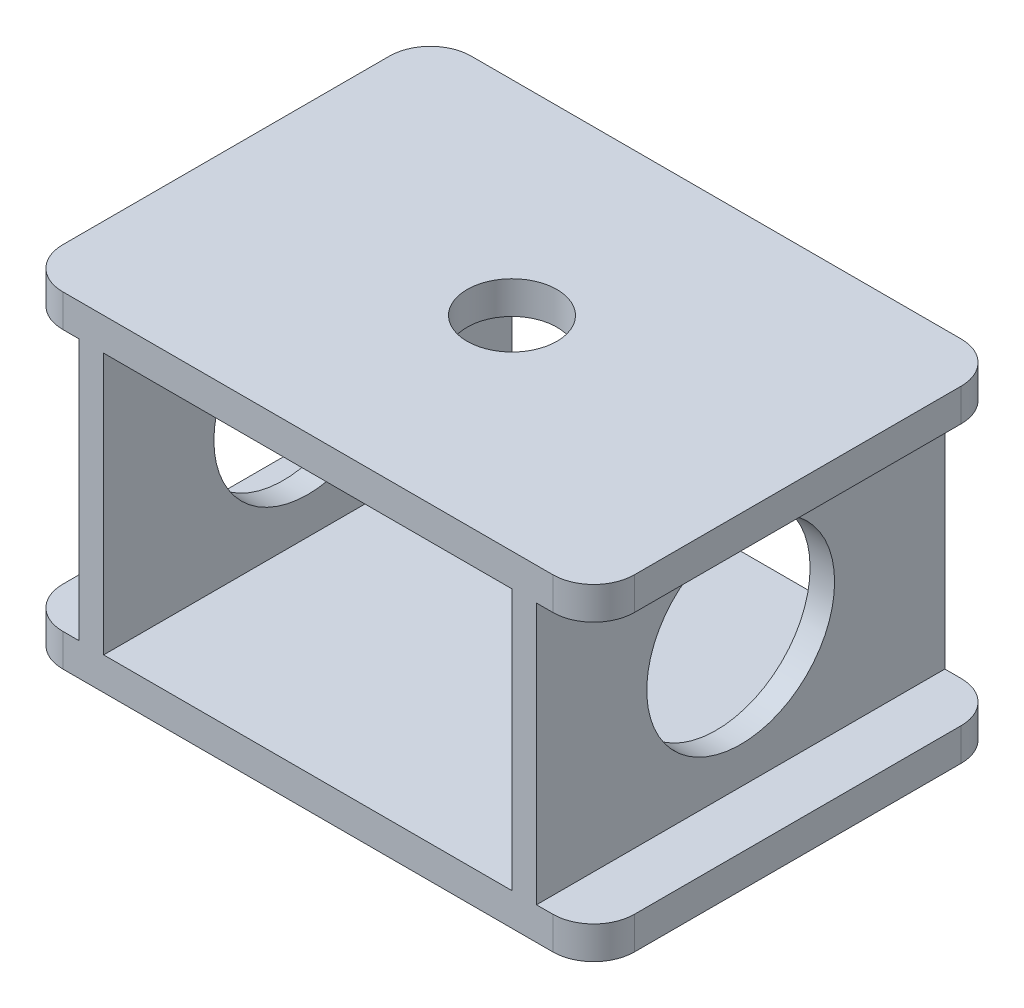
ISO-10303-21;
HEADER;
FILE_DESCRIPTION(('STEP AP214'),'2;1');
FILE_NAME('part.step','',(''),(''),'','','');
FILE_SCHEMA(('AUTOMOTIVE_DESIGN { 1 0 10303 214 1 1 1 1 }'));
ENDSEC;
DATA;
#1=APPLICATION_CONTEXT('core data for automotive mechanical design processes');
#2=APPLICATION_PROTOCOL_DEFINITION('international standard','automotive_design',2000,#1);
#3=PRODUCT_CONTEXT('',#1,'mechanical');
#4=PRODUCT('Part','Part','',(#3));
#5=PRODUCT_RELATED_PRODUCT_CATEGORY('part','',(#4));
#6=PRODUCT_DEFINITION_FORMATION('','',#4);
#7=PRODUCT_DEFINITION_CONTEXT('part definition',#1,'design');
#8=PRODUCT_DEFINITION('design','',#6,#7);
#9=PRODUCT_DEFINITION_SHAPE('','',#8);
#10=(LENGTH_UNIT() NAMED_UNIT(*) SI_UNIT(.MILLI.,.METRE.));
#11=(NAMED_UNIT(*) PLANE_ANGLE_UNIT() SI_UNIT($,.RADIAN.));
#12=(NAMED_UNIT(*) SI_UNIT($,.STERADIAN.) SOLID_ANGLE_UNIT());
#13=UNCERTAINTY_MEASURE_WITH_UNIT(LENGTH_MEASURE(1.E-05),#10,'distance_accuracy_value','');
#14=(GEOMETRIC_REPRESENTATION_CONTEXT(3) GLOBAL_UNCERTAINTY_ASSIGNED_CONTEXT((#13)) GLOBAL_UNIT_ASSIGNED_CONTEXT((#10,
#11,#12)) REPRESENTATION_CONTEXT('',''));
#15=CARTESIAN_POINT('',(0.,0.,0.));
#16=DIRECTION('',(0.,0.,1.));
#17=DIRECTION('',(1.,0.,0.));
#18=AXIS2_PLACEMENT_3D('',#15,#16,#17);
#19=CARTESIAN_POINT('',(30.,4.,20.));
#20=DIRECTION('',(0.,1.,0.));
#21=DIRECTION('',(0.,0.,1.));
#22=AXIS2_PLACEMENT_3D('',#19,#20,#21);
#23=PLANE('',#22);
#24=DIRECTION('',(1.,0.,0.));
#25=VECTOR('',#24,1.);
#26=CARTESIAN_POINT('',(-30.,4.,25.));
#27=LINE('',#26,#25);
#28=CARTESIAN_POINT('',(-25.,4.,25.));
#29=VERTEX_POINT('',#28);
#30=CARTESIAN_POINT('',(25.,4.,25.));
#31=VERTEX_POINT('',#30);
#32=EDGE_CURVE('E293',#29,#31,#27,.T.);
#33=ORIENTED_EDGE('',*,*,#32,.T.);
#34=DIRECTION('',(0.,0.,1.));
#35=VECTOR('',#34,1.);
#36=CARTESIAN_POINT('',(25.,4.,-25.));
#37=LINE('',#36,#35);
#38=CARTESIAN_POINT('',(25.,4.,-25.));
#39=VERTEX_POINT('',#38);
#40=EDGE_CURVE('E220',#39,#31,#37,.T.);
#41=ORIENTED_EDGE('',*,*,#40,.F.);
#42=DIRECTION('',(-1.,0.,0.));
#43=VECTOR('',#42,1.);
#44=CARTESIAN_POINT('',(-30.,4.,-25.));
#45=LINE('',#44,#43);
#46=CARTESIAN_POINT('',(-25.,4.,-25.));
#47=VERTEX_POINT('',#46);
#48=EDGE_CURVE('E283',#39,#47,#45,.T.);
#49=ORIENTED_EDGE('',*,*,#48,.T.);
#50=DIRECTION('',(0.,0.,-1.));
#51=VECTOR('',#50,1.);
#52=CARTESIAN_POINT('',(-25.,4.,-25.));
#53=LINE('',#52,#51);
#54=EDGE_CURVE('E252',#29,#47,#53,.T.);
#55=ORIENTED_EDGE('',*,*,#54,.F.);
#56=EDGE_LOOP('',(#33,#41,#49,#55));
#57=FACE_BOUND('',#56,.T.);
#58=ADVANCED_FACE('F36',(#57),#23,.T.);
#59=CARTESIAN_POINT('',(30.,4.,-25.));
#60=VERTEX_POINT('',#59);
#61=CARTESIAN_POINT('',(28.,4.,-25.));
#62=VERTEX_POINT('',#61);
#63=EDGE_CURVE('E51',#60,#62,#45,.T.);
#64=ORIENTED_EDGE('',*,*,#63,.T.);
#65=DIRECTION('',(0.,0.,-1.));
#66=VECTOR('',#65,1.);
#67=CARTESIAN_POINT('',(28.,4.,-25.));
#68=LINE('',#67,#66);
#69=CARTESIAN_POINT('',(28.,4.,25.));
#70=VERTEX_POINT('',#69);
#71=EDGE_CURVE('E55',#70,#62,#68,.T.);
#72=ORIENTED_EDGE('',*,*,#71,.F.);
#73=CARTESIAN_POINT('',(30.,4.,25.));
#74=VERTEX_POINT('',#73);
#75=EDGE_CURVE('E289',#70,#74,#27,.T.);
#76=ORIENTED_EDGE('',*,*,#75,.T.);
#77=CARTESIAN_POINT('',(30.,4.,20.));
#78=DIRECTION('',(0.,1.,0.));
#79=DIRECTION('',(0.,0.,1.));
#80=AXIS2_PLACEMENT_3D('',#77,#78,#79);
#81=CIRCLE('',#80,5.);
#82=CARTESIAN_POINT('',(35.,4.,20.));
#83=VERTEX_POINT('',#82);
#84=EDGE_CURVE('E272',#74,#83,#81,.T.);
#85=ORIENTED_EDGE('',*,*,#84,.T.);
#86=DIRECTION('',(0.,0.,-1.));
#87=VECTOR('',#86,1.);
#88=CARTESIAN_POINT('',(35.,4.,-20.));
#89=LINE('',#88,#87);
#90=CARTESIAN_POINT('',(35.,4.,-20.));
#91=VERTEX_POINT('',#90);
#92=EDGE_CURVE('E275',#83,#91,#89,.T.);
#93=ORIENTED_EDGE('',*,*,#92,.T.);
#94=CARTESIAN_POINT('',(30.,4.,-20.));
#95=DIRECTION('',(0.,1.,0.));
#96=DIRECTION('',(0.,0.,-1.));
#97=AXIS2_PLACEMENT_3D('',#94,#95,#96);
#98=CIRCLE('',#97,5.);
#99=EDGE_CURVE('E278',#91,#60,#98,.T.);
#100=ORIENTED_EDGE('',*,*,#99,.T.);
#101=EDGE_LOOP('',(#64,#72,#76,#85,#93,#100));
#102=FACE_BOUND('',#101,.T.);
#103=ADVANCED_FACE('F459',(#102),#23,.T.);
#104=DIRECTION('',(0.,0.,1.));
#105=VECTOR('',#104,1.);
#106=CARTESIAN_POINT('',(-28.,4.,-25.));
#107=LINE('',#106,#105);
#108=CARTESIAN_POINT('',(-28.,4.,-25.));
#109=VERTEX_POINT('',#108);
#110=CARTESIAN_POINT('',(-28.,4.,25.));
#111=VERTEX_POINT('',#110);
#112=EDGE_CURVE('E247',#109,#111,#107,.T.);
#113=ORIENTED_EDGE('',*,*,#112,.F.);
#114=CARTESIAN_POINT('',(-30.,4.,-25.));
#115=VERTEX_POINT('',#114);
#116=EDGE_CURVE('E280',#109,#115,#45,.T.);
#117=ORIENTED_EDGE('',*,*,#116,.T.);
#118=CARTESIAN_POINT('',(-30.,4.,-20.));
#119=DIRECTION('',(0.,1.,0.));
#120=DIRECTION('',(0.,0.,1.));
#121=AXIS2_PLACEMENT_3D('',#118,#119,#120);
#122=CIRCLE('',#121,5.);
#123=CARTESIAN_POINT('',(-35.,4.,-20.));
#124=VERTEX_POINT('',#123);
#125=EDGE_CURVE('E282',#115,#124,#122,.T.);
#126=ORIENTED_EDGE('',*,*,#125,.T.);
#127=DIRECTION('',(0.,0.,1.));
#128=VECTOR('',#127,1.);
#129=CARTESIAN_POINT('',(-35.,4.,-20.));
#130=LINE('',#129,#128);
#131=CARTESIAN_POINT('',(-35.,4.,20.));
#132=VERTEX_POINT('',#131);
#133=EDGE_CURVE('E285',#124,#132,#130,.T.);
#134=ORIENTED_EDGE('',*,*,#133,.T.);
#135=CARTESIAN_POINT('',(-30.,4.,20.));
#136=DIRECTION('',(0.,1.,0.));
#137=DIRECTION('',(0.,0.,1.));
#138=AXIS2_PLACEMENT_3D('',#135,#136,#137);
#139=CIRCLE('',#138,5.);
#140=CARTESIAN_POINT('',(-30.,4.,25.));
#141=VERTEX_POINT('',#140);
#142=EDGE_CURVE('E287',#132,#141,#139,.T.);
#143=ORIENTED_EDGE('',*,*,#142,.T.);
#144=EDGE_CURVE('E290',#141,#111,#27,.T.);
#145=ORIENTED_EDGE('',*,*,#144,.T.);
#146=EDGE_LOOP('',(#113,#117,#126,#134,#143,#145));
#147=FACE_BOUND('',#146,.T.);
#148=ADVANCED_FACE('F351',(#147),#23,.T.);
#149=CARTESIAN_POINT('',(30.,4.,20.));
#150=DIRECTION('',(0.,-1.,0.));
#151=DIRECTION('',(0.,0.,-1.));
#152=AXIS2_PLACEMENT_3D('',#149,#150,#151);
#153=CYLINDRICAL_SURFACE('',#152,5.);
#154=CARTESIAN_POINT('',(30.,0.,20.));
#155=DIRECTION('',(0.,1.,0.));
#156=DIRECTION('',(0.,0.,1.));
#157=AXIS2_PLACEMENT_3D('',#154,#155,#156);
#158=CIRCLE('',#157,5.);
#159=CARTESIAN_POINT('',(30.,0.,25.));
#160=VERTEX_POINT('',#159);
#161=CARTESIAN_POINT('',(35.,0.,20.));
#162=VERTEX_POINT('',#161);
#163=EDGE_CURVE('E271',#160,#162,#158,.T.);
#164=ORIENTED_EDGE('',*,*,#163,.T.);
#165=DIRECTION('',(0.,-1.,0.));
#166=VECTOR('',#165,1.);
#167=CARTESIAN_POINT('',(35.,4.,20.));
#168=LINE('',#167,#166);
#169=EDGE_CURVE('E11',#83,#162,#168,.T.);
#170=ORIENTED_EDGE('',*,*,#169,.F.);
#171=ORIENTED_EDGE('',*,*,#84,.F.);
#172=DIRECTION('',(0.,-1.,0.));
#173=VECTOR('',#172,1.);
#174=CARTESIAN_POINT('',(30.,4.,25.));
#175=LINE('',#174,#173);
#176=EDGE_CURVE('E292',#74,#160,#175,.T.);
#177=ORIENTED_EDGE('',*,*,#176,.T.);
#178=EDGE_LOOP('',(#164,#170,#171,#177));
#179=FACE_BOUND('',#178,.T.);
#180=ADVANCED_FACE('F38',(#179),#153,.T.);
#181=CARTESIAN_POINT('',(35.,4.,-20.));
#182=DIRECTION('',(-1.,0.,0.));
#183=DIRECTION('',(0.,0.,1.));
#184=AXIS2_PLACEMENT_3D('',#181,#182,#183);
#185=PLANE('',#184);
#186=DIRECTION('',(0.,0.,-1.));
#187=VECTOR('',#186,1.);
#188=CARTESIAN_POINT('',(35.,0.,-20.));
#189=LINE('',#188,#187);
#190=CARTESIAN_POINT('',(35.,0.,-20.));
#191=VERTEX_POINT('',#190);
#192=EDGE_CURVE('E296',#162,#191,#189,.T.);
#193=ORIENTED_EDGE('',*,*,#192,.T.);
#194=DIRECTION('',(0.,-1.,0.));
#195=VECTOR('',#194,1.);
#196=CARTESIAN_POINT('',(35.,4.,-20.));
#197=LINE('',#196,#195);
#198=EDGE_CURVE('E44',#91,#191,#197,.T.);
#199=ORIENTED_EDGE('',*,*,#198,.F.);
#200=ORIENTED_EDGE('',*,*,#92,.F.);
#201=ORIENTED_EDGE('',*,*,#169,.T.);
#202=EDGE_LOOP('',(#193,#199,#200,#201));
#203=FACE_BOUND('',#202,.T.);
#204=ADVANCED_FACE('F470',(#203),#185,.F.);
#205=CARTESIAN_POINT('',(30.,4.,-20.));
#206=DIRECTION('',(0.,-1.,0.));
#207=DIRECTION('',(0.,0.,-1.));
#208=AXIS2_PLACEMENT_3D('',#205,#206,#207);
#209=CYLINDRICAL_SURFACE('',#208,5.);
#210=CARTESIAN_POINT('',(30.,0.,-20.));
#211=DIRECTION('',(0.,1.,0.));
#212=DIRECTION('',(0.,0.,-1.));
#213=AXIS2_PLACEMENT_3D('',#210,#211,#212);
#214=CIRCLE('',#213,5.);
#215=CARTESIAN_POINT('',(30.,0.,-25.));
#216=VERTEX_POINT('',#215);
#217=EDGE_CURVE('E298',#191,#216,#214,.T.);
#218=ORIENTED_EDGE('',*,*,#217,.T.);
#219=DIRECTION('',(0.,-1.,0.));
#220=VECTOR('',#219,1.);
#221=CARTESIAN_POINT('',(30.,4.,-25.));
#222=LINE('',#221,#220);
#223=EDGE_CURVE('E323',#60,#216,#222,.T.);
#224=ORIENTED_EDGE('',*,*,#223,.F.);
#225=ORIENTED_EDGE('',*,*,#99,.F.);
#226=ORIENTED_EDGE('',*,*,#198,.T.);
#227=EDGE_LOOP('',(#218,#224,#225,#226));
#228=FACE_BOUND('',#227,.T.);
#229=ADVANCED_FACE('F330',(#228),#209,.T.);
#230=CARTESIAN_POINT('',(-30.,4.,-25.));
#231=DIRECTION('',(0.,0.,1.));
#232=DIRECTION('',(1.,0.,0.));
#233=AXIS2_PLACEMENT_3D('',#230,#231,#232);
#234=PLANE('',#233);
#235=DIRECTION('',(0.,-1.,0.));
#236=VECTOR('',#235,1.);
#237=CARTESIAN_POINT('',(-28.,36.,-25.));
#238=LINE('',#237,#236);
#239=CARTESIAN_POINT('',(-28.,36.,-25.));
#240=VERTEX_POINT('',#239);
#241=EDGE_CURVE('E255',#240,#109,#238,.T.);
#242=ORIENTED_EDGE('',*,*,#241,.F.);
#243=DIRECTION('',(-1.,0.,0.));
#244=VECTOR('',#243,1.);
#245=CARTESIAN_POINT('',(0.,36.,-25.));
#246=LINE('',#245,#244);
#247=CARTESIAN_POINT('',(-30.,36.,-25.));
#248=VERTEX_POINT('',#247);
#249=EDGE_CURVE('E365',#240,#248,#246,.T.);
#250=ORIENTED_EDGE('',*,*,#249,.T.);
#251=DIRECTION('',(0.,-1.,0.));
#252=VECTOR('',#251,1.);
#253=CARTESIAN_POINT('',(-30.,40.,-25.));
#254=LINE('',#253,#252);
#255=CARTESIAN_POINT('',(-30.,40.,-25.));
#256=VERTEX_POINT('',#255);
#257=EDGE_CURVE('E375',#256,#248,#254,.T.);
#258=ORIENTED_EDGE('',*,*,#257,.F.);
#259=DIRECTION('',(-1.,0.,0.));
#260=VECTOR('',#259,1.);
#261=CARTESIAN_POINT('',(0.,40.,-25.));
#262=LINE('',#261,#260);
#263=CARTESIAN_POINT('',(30.,40.,-25.));
#264=VERTEX_POINT('',#263);
#265=EDGE_CURVE('E414',#264,#256,#262,.T.);
#266=ORIENTED_EDGE('',*,*,#265,.F.);
#267=DIRECTION('',(0.,-1.,0.));
#268=VECTOR('',#267,1.);
#269=CARTESIAN_POINT('',(30.,40.,-25.));
#270=LINE('',#269,#268);
#271=CARTESIAN_POINT('',(30.,36.,-25.));
#272=VERTEX_POINT('',#271);
#273=EDGE_CURVE('E378',#264,#272,#270,.T.);
#274=ORIENTED_EDGE('',*,*,#273,.T.);
#275=CARTESIAN_POINT('',(28.,36.,-25.));
#276=VERTEX_POINT('',#275);
#277=EDGE_CURVE('E364',#272,#276,#246,.T.);
#278=ORIENTED_EDGE('',*,*,#277,.T.);
#279=DIRECTION('',(0.,-1.,0.));
#280=VECTOR('',#279,1.);
#281=CARTESIAN_POINT('',(28.,36.,-25.));
#282=LINE('',#281,#280);
#283=EDGE_CURVE('E238',#276,#62,#282,.T.);
#284=ORIENTED_EDGE('',*,*,#283,.T.);
#285=ORIENTED_EDGE('',*,*,#63,.F.);
#286=ORIENTED_EDGE('',*,*,#223,.T.);
#287=DIRECTION('',(-1.,0.,0.));
#288=VECTOR('',#287,1.);
#289=CARTESIAN_POINT('',(-30.,0.,-25.));
#290=LINE('',#289,#288);
#291=CARTESIAN_POINT('',(-30.,0.,-25.));
#292=VERTEX_POINT('',#291);
#293=EDGE_CURVE('E300',#216,#292,#290,.T.);
#294=ORIENTED_EDGE('',*,*,#293,.T.);
#295=DIRECTION('',(0.,-1.,0.));
#296=VECTOR('',#295,1.);
#297=CARTESIAN_POINT('',(-30.,4.,-25.));
#298=LINE('',#297,#296);
#299=EDGE_CURVE('E320',#115,#292,#298,.T.);
#300=ORIENTED_EDGE('',*,*,#299,.F.);
#301=ORIENTED_EDGE('',*,*,#116,.F.);
#302=EDGE_LOOP('',(#242,#250,#258,#266,#274,#278,#284,#285,#286,#294,#300,#301));
#303=FACE_BOUND('',#302,.T.);
#304=CARTESIAN_POINT('',(25.,36.,-25.));
#305=VERTEX_POINT('',#304);
#306=CARTESIAN_POINT('',(-25.,36.,-25.));
#307=VERTEX_POINT('',#306);
#308=EDGE_CURVE('E362',#305,#307,#246,.T.);
#309=ORIENTED_EDGE('',*,*,#308,.T.);
#310=DIRECTION('',(0.,-1.,0.));
#311=VECTOR('',#310,1.);
#312=CARTESIAN_POINT('',(-25.,36.,-25.));
#313=LINE('',#312,#311);
#314=EDGE_CURVE('E262',#307,#47,#313,.T.);
#315=ORIENTED_EDGE('',*,*,#314,.T.);
#316=ORIENTED_EDGE('',*,*,#48,.F.);
#317=DIRECTION('',(0.,-1.,0.));
#318=VECTOR('',#317,1.);
#319=CARTESIAN_POINT('',(25.,36.,-25.));
#320=LINE('',#319,#318);
#321=EDGE_CURVE('E233',#305,#39,#320,.T.);
#322=ORIENTED_EDGE('',*,*,#321,.F.);
#323=EDGE_LOOP('',(#309,#315,#316,#322));
#324=FACE_BOUND('',#323,.T.);
#325=ADVANCED_FACE('F342',(#303,#324),#234,.F.);
#326=CARTESIAN_POINT('',(-30.,4.,-20.));
#327=DIRECTION('',(0.,-1.,0.));
#328=DIRECTION('',(0.,0.,-1.));
#329=AXIS2_PLACEMENT_3D('',#326,#327,#328);
#330=CYLINDRICAL_SURFACE('',#329,5.);
#331=CARTESIAN_POINT('',(-30.,0.,-20.));
#332=DIRECTION('',(0.,1.,0.));
#333=DIRECTION('',(0.,0.,1.));
#334=AXIS2_PLACEMENT_3D('',#331,#332,#333);
#335=CIRCLE('',#334,5.);
#336=CARTESIAN_POINT('',(-35.,0.,-20.));
#337=VERTEX_POINT('',#336);
#338=EDGE_CURVE('E302',#292,#337,#335,.T.);
#339=ORIENTED_EDGE('',*,*,#338,.T.);
#340=DIRECTION('',(0.,-1.,0.));
#341=VECTOR('',#340,1.);
#342=CARTESIAN_POINT('',(-35.,4.,-20.));
#343=LINE('',#342,#341);
#344=EDGE_CURVE('E317',#124,#337,#343,.T.);
#345=ORIENTED_EDGE('',*,*,#344,.F.);
#346=ORIENTED_EDGE('',*,*,#125,.F.);
#347=ORIENTED_EDGE('',*,*,#299,.T.);
#348=EDGE_LOOP('',(#339,#345,#346,#347));
#349=FACE_BOUND('',#348,.T.);
#350=ADVANCED_FACE('F347',(#349),#330,.T.);
#351=CARTESIAN_POINT('',(-35.,4.,-20.));
#352=DIRECTION('',(1.,0.,0.));
#353=DIRECTION('',(0.,0.,-1.));
#354=AXIS2_PLACEMENT_3D('',#351,#352,#353);
#355=PLANE('',#354);
#356=DIRECTION('',(0.,0.,1.));
#357=VECTOR('',#356,1.);
#358=CARTESIAN_POINT('',(-35.,0.,-20.));
#359=LINE('',#358,#357);
#360=CARTESIAN_POINT('',(-35.,0.,20.));
#361=VERTEX_POINT('',#360);
#362=EDGE_CURVE('E304',#337,#361,#359,.T.);
#363=ORIENTED_EDGE('',*,*,#362,.T.);
#364=DIRECTION('',(0.,-1.,0.));
#365=VECTOR('',#364,1.);
#366=CARTESIAN_POINT('',(-35.,4.,20.));
#367=LINE('',#366,#365);
#368=EDGE_CURVE('E314',#132,#361,#367,.T.);
#369=ORIENTED_EDGE('',*,*,#368,.F.);
#370=ORIENTED_EDGE('',*,*,#133,.F.);
#371=ORIENTED_EDGE('',*,*,#344,.T.);
#372=EDGE_LOOP('',(#363,#369,#370,#371));
#373=FACE_BOUND('',#372,.T.);
#374=ADVANCED_FACE('F487',(#373),#355,.F.);
#375=CARTESIAN_POINT('',(-30.,4.,20.));
#376=DIRECTION('',(0.,-1.,0.));
#377=DIRECTION('',(0.,0.,-1.));
#378=AXIS2_PLACEMENT_3D('',#375,#376,#377);
#379=CYLINDRICAL_SURFACE('',#378,5.);
#380=CARTESIAN_POINT('',(-30.,0.,20.));
#381=DIRECTION('',(0.,1.,0.));
#382=DIRECTION('',(0.,0.,1.));
#383=AXIS2_PLACEMENT_3D('',#380,#381,#382);
#384=CIRCLE('',#383,5.);
#385=CARTESIAN_POINT('',(-30.,0.,25.));
#386=VERTEX_POINT('',#385);
#387=EDGE_CURVE('E306',#361,#386,#384,.T.);
#388=ORIENTED_EDGE('',*,*,#387,.T.);
#389=DIRECTION('',(0.,-1.,0.));
#390=VECTOR('',#389,1.);
#391=CARTESIAN_POINT('',(-30.,4.,25.));
#392=LINE('',#391,#390);
#393=EDGE_CURVE('E311',#141,#386,#392,.T.);
#394=ORIENTED_EDGE('',*,*,#393,.F.);
#395=ORIENTED_EDGE('',*,*,#142,.F.);
#396=ORIENTED_EDGE('',*,*,#368,.T.);
#397=EDGE_LOOP('',(#388,#394,#395,#396));
#398=FACE_BOUND('',#397,.T.);
#399=ADVANCED_FACE('F485',(#398),#379,.T.);
#400=CARTESIAN_POINT('',(-30.,4.,25.));
#401=DIRECTION('',(0.,0.,-1.));
#402=DIRECTION('',(-1.,0.,0.));
#403=AXIS2_PLACEMENT_3D('',#400,#401,#402);
#404=PLANE('',#403);
#405=DIRECTION('',(0.,-1.,0.));
#406=VECTOR('',#405,1.);
#407=CARTESIAN_POINT('',(-25.,36.,25.));
#408=LINE('',#407,#406);
#409=CARTESIAN_POINT('',(-25.,36.,25.));
#410=VERTEX_POINT('',#409);
#411=EDGE_CURVE('E265',#410,#29,#408,.T.);
#412=ORIENTED_EDGE('',*,*,#411,.F.);
#413=DIRECTION('',(1.,0.,0.));
#414=VECTOR('',#413,1.);
#415=CARTESIAN_POINT('',(0.,36.,25.));
#416=LINE('',#415,#414);
#417=CARTESIAN_POINT('',(25.,36.,25.));
#418=VERTEX_POINT('',#417);
#419=EDGE_CURVE('E406',#410,#418,#416,.T.);
#420=ORIENTED_EDGE('',*,*,#419,.T.);
#421=DIRECTION('',(0.,-1.,0.));
#422=VECTOR('',#421,1.);
#423=CARTESIAN_POINT('',(25.,36.,25.));
#424=LINE('',#423,#422);
#425=EDGE_CURVE('E244',#418,#31,#424,.T.);
#426=ORIENTED_EDGE('',*,*,#425,.T.);
#427=ORIENTED_EDGE('',*,*,#32,.F.);
#428=EDGE_LOOP('',(#412,#420,#426,#427));
#429=FACE_BOUND('',#428,.T.);
#430=DIRECTION('',(1.,0.,0.));
#431=VECTOR('',#430,1.);
#432=CARTESIAN_POINT('',(-30.,0.,25.));
#433=LINE('',#432,#431);
#434=EDGE_CURVE('E276',#386,#160,#433,.T.);
#435=ORIENTED_EDGE('',*,*,#434,.T.);
#436=ORIENTED_EDGE('',*,*,#176,.F.);
#437=ORIENTED_EDGE('',*,*,#75,.F.);
#438=DIRECTION('',(0.,-1.,0.));
#439=VECTOR('',#438,1.);
#440=CARTESIAN_POINT('',(28.,36.,25.));
#441=LINE('',#440,#439);
#442=CARTESIAN_POINT('',(28.,36.,25.));
#443=VERTEX_POINT('',#442);
#444=EDGE_CURVE('E241',#443,#70,#441,.T.);
#445=ORIENTED_EDGE('',*,*,#444,.F.);
#446=CARTESIAN_POINT('',(30.,36.,25.));
#447=VERTEX_POINT('',#446);
#448=EDGE_CURVE('E400',#443,#447,#416,.T.);
#449=ORIENTED_EDGE('',*,*,#448,.T.);
#450=DIRECTION('',(0.,-1.,0.));
#451=VECTOR('',#450,1.);
#452=CARTESIAN_POINT('',(30.,40.,25.));
#453=LINE('',#452,#451);
#454=CARTESIAN_POINT('',(30.,40.,25.));
#455=VERTEX_POINT('',#454);
#456=EDGE_CURVE('E224',#455,#447,#453,.T.);
#457=ORIENTED_EDGE('',*,*,#456,.F.);
#458=DIRECTION('',(1.,0.,0.));
#459=VECTOR('',#458,1.);
#460=CARTESIAN_POINT('',(0.,40.,25.));
#461=LINE('',#460,#459);
#462=CARTESIAN_POINT('',(-30.,40.,25.));
#463=VERTEX_POINT('',#462);
#464=EDGE_CURVE('E205',#463,#455,#461,.T.);
#465=ORIENTED_EDGE('',*,*,#464,.F.);
#466=DIRECTION('',(0.,-1.,0.));
#467=VECTOR('',#466,1.);
#468=CARTESIAN_POINT('',(-30.,40.,25.));
#469=LINE('',#468,#467);
#470=CARTESIAN_POINT('',(-30.,36.,25.));
#471=VERTEX_POINT('',#470);
#472=EDGE_CURVE('E202',#463,#471,#469,.T.);
#473=ORIENTED_EDGE('',*,*,#472,.T.);
#474=CARTESIAN_POINT('',(-28.,36.,25.));
#475=VERTEX_POINT('',#474);
#476=EDGE_CURVE('E403',#471,#475,#416,.T.);
#477=ORIENTED_EDGE('',*,*,#476,.T.);
#478=DIRECTION('',(0.,-1.,0.));
#479=VECTOR('',#478,1.);
#480=CARTESIAN_POINT('',(-28.,36.,25.));
#481=LINE('',#480,#479);
#482=EDGE_CURVE('E268',#475,#111,#481,.T.);
#483=ORIENTED_EDGE('',*,*,#482,.T.);
#484=ORIENTED_EDGE('',*,*,#144,.F.);
#485=ORIENTED_EDGE('',*,*,#393,.T.);
#486=EDGE_LOOP('',(#435,#436,#437,#445,#449,#457,#465,#473,#477,#483,#484,#485));
#487=FACE_BOUND('',#486,.T.);
#488=ADVANCED_FACE('F480',(#429,#487),#404,.F.);
#489=CARTESIAN_POINT('',(30.,0.,20.));
#490=DIRECTION('',(0.,1.,0.));
#491=DIRECTION('',(0.,0.,1.));
#492=AXIS2_PLACEMENT_3D('',#489,#490,#491);
#493=PLANE('',#492);
#494=ORIENTED_EDGE('',*,*,#163,.F.);
#495=ORIENTED_EDGE('',*,*,#434,.F.);
#496=ORIENTED_EDGE('',*,*,#387,.F.);
#497=ORIENTED_EDGE('',*,*,#362,.F.);
#498=ORIENTED_EDGE('',*,*,#338,.F.);
#499=ORIENTED_EDGE('',*,*,#293,.F.);
#500=ORIENTED_EDGE('',*,*,#217,.F.);
#501=ORIENTED_EDGE('',*,*,#192,.F.);
#502=EDGE_LOOP('',(#494,#495,#496,#497,#498,#499,#500,#501));
#503=FACE_BOUND('',#502,.T.);
#504=ADVANCED_FACE('F336',(#503),#493,.F.);
#505=CARTESIAN_POINT('',(-28.,36.,-25.));
#506=DIRECTION('',(1.,0.,0.));
#507=DIRECTION('',(0.,0.,-1.));
#508=AXIS2_PLACEMENT_3D('',#505,#506,#507);
#509=PLANE('',#508);
#510=CARTESIAN_POINT('',(-28.,20.,0.));
#511=DIRECTION('',(1.,0.,0.));
#512=DIRECTION('',(0.,0.,-1.));
#513=AXIS2_PLACEMENT_3D('',#510,#511,#512);
#514=CIRCLE('',#513,11.5);
#515=CARTESIAN_POINT('',(-28.,20.,-11.5));
#516=VERTEX_POINT('',#515);
#517=EDGE_CURVE('E412',#516,#516,#514,.T.);
#518=ORIENTED_EDGE('',*,*,#517,.T.);
#519=EDGE_LOOP('',(#518));
#520=FACE_BOUND('',#519,.T.);
#521=ORIENTED_EDGE('',*,*,#112,.T.);
#522=ORIENTED_EDGE('',*,*,#482,.F.);
#523=DIRECTION('',(0.,0.,1.));
#524=VECTOR('',#523,1.);
#525=CARTESIAN_POINT('',(-28.,36.,-25.));
#526=LINE('',#525,#524);
#527=EDGE_CURVE('E248',#240,#475,#526,.T.);
#528=ORIENTED_EDGE('',*,*,#527,.F.);
#529=ORIENTED_EDGE('',*,*,#241,.T.);
#530=EDGE_LOOP('',(#521,#522,#528,#529));
#531=FACE_BOUND('',#530,.T.);
#532=ADVANCED_FACE('F535',(#520,#531),#509,.F.);
#533=CARTESIAN_POINT('',(-25.,36.,-25.));
#534=DIRECTION('',(-1.,0.,0.));
#535=DIRECTION('',(0.,0.,1.));
#536=AXIS2_PLACEMENT_3D('',#533,#534,#535);
#537=PLANE('',#536);
#538=CARTESIAN_POINT('',(-25.,20.,0.));
#539=DIRECTION('',(-1.,0.,0.));
#540=DIRECTION('',(0.,0.,1.));
#541=AXIS2_PLACEMENT_3D('',#538,#539,#540);
#542=CIRCLE('',#541,11.5);
#543=CARTESIAN_POINT('',(-25.,20.,11.5));
#544=VERTEX_POINT('',#543);
#545=EDGE_CURVE('E424',#544,#544,#542,.T.);
#546=ORIENTED_EDGE('',*,*,#545,.T.);
#547=EDGE_LOOP('',(#546));
#548=FACE_BOUND('',#547,.T.);
#549=ORIENTED_EDGE('',*,*,#54,.T.);
#550=ORIENTED_EDGE('',*,*,#314,.F.);
#551=DIRECTION('',(0.,0.,-1.));
#552=VECTOR('',#551,1.);
#553=CARTESIAN_POINT('',(-25.,36.,-25.));
#554=LINE('',#553,#552);
#555=EDGE_CURVE('E251',#410,#307,#554,.T.);
#556=ORIENTED_EDGE('',*,*,#555,.F.);
#557=ORIENTED_EDGE('',*,*,#411,.T.);
#558=EDGE_LOOP('',(#549,#550,#556,#557));
#559=FACE_BOUND('',#558,.T.);
#560=ADVANCED_FACE('F358',(#548,#559),#537,.F.);
#561=CARTESIAN_POINT('',(25.,36.,-25.));
#562=DIRECTION('',(1.,0.,0.));
#563=DIRECTION('',(0.,0.,-1.));
#564=AXIS2_PLACEMENT_3D('',#561,#562,#563);
#565=PLANE('',#564);
#566=CARTESIAN_POINT('',(25.,20.,0.));
#567=DIRECTION('',(1.,0.,0.));
#568=DIRECTION('',(0.,0.,-1.));
#569=AXIS2_PLACEMENT_3D('',#566,#567,#568);
#570=CIRCLE('',#569,11.5);
#571=CARTESIAN_POINT('',(25.,20.,-11.5));
#572=VERTEX_POINT('',#571);
#573=EDGE_CURVE('E427',#572,#572,#570,.T.);
#574=ORIENTED_EDGE('',*,*,#573,.T.);
#575=EDGE_LOOP('',(#574));
#576=FACE_BOUND('',#575,.T.);
#577=ORIENTED_EDGE('',*,*,#40,.T.);
#578=ORIENTED_EDGE('',*,*,#425,.F.);
#579=DIRECTION('',(0.,0.,1.));
#580=VECTOR('',#579,1.);
#581=CARTESIAN_POINT('',(25.,36.,-25.));
#582=LINE('',#581,#580);
#583=EDGE_CURVE('E228',#305,#418,#582,.T.);
#584=ORIENTED_EDGE('',*,*,#583,.F.);
#585=ORIENTED_EDGE('',*,*,#321,.T.);
#586=EDGE_LOOP('',(#577,#578,#584,#585));
#587=FACE_BOUND('',#586,.T.);
#588=ADVANCED_FACE('F593',(#576,#587),#565,.F.);
#589=CARTESIAN_POINT('',(28.,36.,-25.));
#590=DIRECTION('',(-1.,0.,0.));
#591=DIRECTION('',(0.,0.,1.));
#592=AXIS2_PLACEMENT_3D('',#589,#590,#591);
#593=PLANE('',#592);
#594=CARTESIAN_POINT('',(28.,20.,0.));
#595=DIRECTION('',(1.,0.,0.));
#596=DIRECTION('',(0.,0.,-1.));
#597=AXIS2_PLACEMENT_3D('',#594,#595,#596);
#598=CIRCLE('',#597,11.5);
#599=CARTESIAN_POINT('',(28.,20.,-11.5));
#600=VERTEX_POINT('',#599);
#601=EDGE_CURVE('E430',#600,#600,#598,.T.);
#602=ORIENTED_EDGE('',*,*,#601,.F.);
#603=EDGE_LOOP('',(#602));
#604=FACE_BOUND('',#603,.T.);
#605=ORIENTED_EDGE('',*,*,#71,.T.);
#606=ORIENTED_EDGE('',*,*,#283,.F.);
#607=DIRECTION('',(0.,0.,-1.));
#608=VECTOR('',#607,1.);
#609=CARTESIAN_POINT('',(28.,36.,-25.));
#610=LINE('',#609,#608);
#611=EDGE_CURVE('E231',#443,#276,#610,.T.);
#612=ORIENTED_EDGE('',*,*,#611,.F.);
#613=ORIENTED_EDGE('',*,*,#444,.T.);
#614=EDGE_LOOP('',(#605,#606,#612,#613));
#615=FACE_BOUND('',#614,.T.);
#616=ADVANCED_FACE('F601',(#604,#615),#593,.F.);
#617=CARTESIAN_POINT('',(0.,36.,0.));
#618=DIRECTION('',(0.,1.,0.));
#619=DIRECTION('',(0.,0.,1.));
#620=AXIS2_PLACEMENT_3D('',#617,#618,#619);
#621=PLANE('',#620);
#622=ORIENTED_EDGE('',*,*,#249,.F.);
#623=ORIENTED_EDGE('',*,*,#527,.T.);
#624=ORIENTED_EDGE('',*,*,#476,.F.);
#625=CARTESIAN_POINT('',(-30.,36.,20.));
#626=DIRECTION('',(0.,1.,0.));
#627=DIRECTION('',(0.,0.,1.));
#628=AXIS2_PLACEMENT_3D('',#625,#626,#627);
#629=CIRCLE('',#628,5.);
#630=CARTESIAN_POINT('',(-35.,36.,20.));
#631=VERTEX_POINT('',#630);
#632=EDGE_CURVE('E409',#631,#471,#629,.T.);
#633=ORIENTED_EDGE('',*,*,#632,.F.);
#634=DIRECTION('',(0.,0.,1.));
#635=VECTOR('',#634,1.);
#636=CARTESIAN_POINT('',(-35.,36.,0.));
#637=LINE('',#636,#635);
#638=CARTESIAN_POINT('',(-35.,36.,-20.));
#639=VERTEX_POINT('',#638);
#640=EDGE_CURVE('E219',#639,#631,#637,.T.);
#641=ORIENTED_EDGE('',*,*,#640,.F.);
#642=CARTESIAN_POINT('',(-30.,36.,-20.));
#643=DIRECTION('',(0.,1.,0.));
#644=DIRECTION('',(0.,0.,1.));
#645=AXIS2_PLACEMENT_3D('',#642,#643,#644);
#646=CIRCLE('',#645,5.);
#647=EDGE_CURVE('E215',#248,#639,#646,.T.);
#648=ORIENTED_EDGE('',*,*,#647,.F.);
#649=EDGE_LOOP('',(#622,#623,#624,#633,#641,#648));
#650=FACE_BOUND('',#649,.T.);
#651=ADVANCED_FACE('F609',(#650),#621,.F.);
#652=CARTESIAN_POINT('',(0.,36.,0.));
#653=DIRECTION('',(0.,1.,0.));
#654=DIRECTION('',(0.,0.,1.));
#655=AXIS2_PLACEMENT_3D('',#652,#653,#654);
#656=CIRCLE('',#655,5.5);
#657=CARTESIAN_POINT('',(0.,36.,5.5));
#658=VERTEX_POINT('',#657);
#659=EDGE_CURVE('E433',#658,#658,#656,.T.);
#660=ORIENTED_EDGE('',*,*,#659,.T.);
#661=EDGE_LOOP('',(#660));
#662=FACE_BOUND('',#661,.T.);
#663=ORIENTED_EDGE('',*,*,#419,.F.);
#664=ORIENTED_EDGE('',*,*,#555,.T.);
#665=ORIENTED_EDGE('',*,*,#308,.F.);
#666=ORIENTED_EDGE('',*,*,#583,.T.);
#667=EDGE_LOOP('',(#663,#664,#665,#666));
#668=FACE_BOUND('',#667,.T.);
#669=ADVANCED_FACE('F633',(#662,#668),#621,.F.);
#670=ORIENTED_EDGE('',*,*,#448,.F.);
#671=ORIENTED_EDGE('',*,*,#611,.T.);
#672=ORIENTED_EDGE('',*,*,#277,.F.);
#673=CARTESIAN_POINT('',(30.,36.,-20.));
#674=DIRECTION('',(0.,1.,0.));
#675=DIRECTION('',(0.,0.,1.));
#676=AXIS2_PLACEMENT_3D('',#673,#674,#675);
#677=CIRCLE('',#676,5.);
#678=CARTESIAN_POINT('',(35.,36.,-20.));
#679=VERTEX_POINT('',#678);
#680=EDGE_CURVE('E368',#679,#272,#677,.T.);
#681=ORIENTED_EDGE('',*,*,#680,.F.);
#682=DIRECTION('',(0.,0.,-1.));
#683=VECTOR('',#682,1.);
#684=CARTESIAN_POINT('',(35.,36.,0.));
#685=LINE('',#684,#683);
#686=CARTESIAN_POINT('',(35.,36.,20.));
#687=VERTEX_POINT('',#686);
#688=EDGE_CURVE('E402',#687,#679,#685,.T.);
#689=ORIENTED_EDGE('',*,*,#688,.F.);
#690=CARTESIAN_POINT('',(30.,36.,20.));
#691=DIRECTION('',(0.,1.,0.));
#692=DIRECTION('',(0.,0.,1.));
#693=AXIS2_PLACEMENT_3D('',#690,#691,#692);
#694=CIRCLE('',#693,5.);
#695=EDGE_CURVE('E393',#447,#687,#694,.T.);
#696=ORIENTED_EDGE('',*,*,#695,.F.);
#697=EDGE_LOOP('',(#670,#671,#672,#681,#689,#696));
#698=FACE_BOUND('',#697,.T.);
#699=ADVANCED_FACE('F399',(#698),#621,.F.);
#700=CARTESIAN_POINT('',(-35.,40.,0.));
#701=DIRECTION('',(1.,0.,0.));
#702=DIRECTION('',(0.,0.,-1.));
#703=AXIS2_PLACEMENT_3D('',#700,#701,#702);
#704=PLANE('',#703);
#705=ORIENTED_EDGE('',*,*,#640,.T.);
#706=DIRECTION('',(0.,-1.,0.));
#707=VECTOR('',#706,1.);
#708=CARTESIAN_POINT('',(-35.,40.,20.));
#709=LINE('',#708,#707);
#710=CARTESIAN_POINT('',(-35.,40.,20.));
#711=VERTEX_POINT('',#710);
#712=EDGE_CURVE('E199',#711,#631,#709,.T.);
#713=ORIENTED_EDGE('',*,*,#712,.F.);
#714=DIRECTION('',(0.,0.,1.));
#715=VECTOR('',#714,1.);
#716=CARTESIAN_POINT('',(-35.,40.,0.));
#717=LINE('',#716,#715);
#718=CARTESIAN_POINT('',(-35.,40.,-20.));
#719=VERTEX_POINT('',#718);
#720=EDGE_CURVE('E206',#719,#711,#717,.T.);
#721=ORIENTED_EDGE('',*,*,#720,.F.);
#722=DIRECTION('',(0.,-1.,0.));
#723=VECTOR('',#722,1.);
#724=CARTESIAN_POINT('',(-35.,40.,-20.));
#725=LINE('',#724,#723);
#726=EDGE_CURVE('E373',#719,#639,#725,.T.);
#727=ORIENTED_EDGE('',*,*,#726,.T.);
#728=EDGE_LOOP('',(#705,#713,#721,#727));
#729=FACE_BOUND('',#728,.T.);
#730=ADVANCED_FACE('F217',(#729),#704,.F.);
#731=CARTESIAN_POINT('',(-30.,40.,20.));
#732=DIRECTION('',(0.,-1.,0.));
#733=DIRECTION('',(0.,0.,-1.));
#734=AXIS2_PLACEMENT_3D('',#731,#732,#733);
#735=CYLINDRICAL_SURFACE('',#734,5.);
#736=ORIENTED_EDGE('',*,*,#632,.T.);
#737=ORIENTED_EDGE('',*,*,#472,.F.);
#738=CARTESIAN_POINT('',(-30.,40.,20.));
#739=DIRECTION('',(0.,1.,0.));
#740=DIRECTION('',(0.,0.,1.));
#741=AXIS2_PLACEMENT_3D('',#738,#739,#740);
#742=CIRCLE('',#741,5.);
#743=EDGE_CURVE('E195',#711,#463,#742,.T.);
#744=ORIENTED_EDGE('',*,*,#743,.F.);
#745=ORIENTED_EDGE('',*,*,#712,.T.);
#746=EDGE_LOOP('',(#736,#737,#744,#745));
#747=FACE_BOUND('',#746,.T.);
#748=ADVANCED_FACE('F197',(#747),#735,.T.);
#749=CARTESIAN_POINT('',(30.,40.,20.));
#750=DIRECTION('',(0.,-1.,0.));
#751=DIRECTION('',(0.,0.,-1.));
#752=AXIS2_PLACEMENT_3D('',#749,#750,#751);
#753=CYLINDRICAL_SURFACE('',#752,5.);
#754=ORIENTED_EDGE('',*,*,#695,.T.);
#755=DIRECTION('',(0.,-1.,0.));
#756=VECTOR('',#755,1.);
#757=CARTESIAN_POINT('',(35.,40.,20.));
#758=LINE('',#757,#756);
#759=CARTESIAN_POINT('',(35.,40.,20.));
#760=VERTEX_POINT('',#759);
#761=EDGE_CURVE('E384',#760,#687,#758,.T.);
#762=ORIENTED_EDGE('',*,*,#761,.F.);
#763=CARTESIAN_POINT('',(30.,40.,20.));
#764=DIRECTION('',(0.,1.,0.));
#765=DIRECTION('',(0.,0.,1.));
#766=AXIS2_PLACEMENT_3D('',#763,#764,#765);
#767=CIRCLE('',#766,5.);
#768=EDGE_CURVE('E394',#455,#760,#767,.T.);
#769=ORIENTED_EDGE('',*,*,#768,.F.);
#770=ORIENTED_EDGE('',*,*,#456,.T.);
#771=EDGE_LOOP('',(#754,#762,#769,#770));
#772=FACE_BOUND('',#771,.T.);
#773=ADVANCED_FACE('F391',(#772),#753,.T.);
#774=CARTESIAN_POINT('',(35.,40.,0.));
#775=DIRECTION('',(-1.,0.,0.));
#776=DIRECTION('',(0.,0.,1.));
#777=AXIS2_PLACEMENT_3D('',#774,#775,#776);
#778=PLANE('',#777);
#779=ORIENTED_EDGE('',*,*,#688,.T.);
#780=DIRECTION('',(0.,-1.,0.));
#781=VECTOR('',#780,1.);
#782=CARTESIAN_POINT('',(35.,40.,-20.));
#783=LINE('',#782,#781);
#784=CARTESIAN_POINT('',(35.,40.,-20.));
#785=VERTEX_POINT('',#784);
#786=EDGE_CURVE('E381',#785,#679,#783,.T.);
#787=ORIENTED_EDGE('',*,*,#786,.F.);
#788=DIRECTION('',(0.,0.,-1.));
#789=VECTOR('',#788,1.);
#790=CARTESIAN_POINT('',(35.,40.,0.));
#791=LINE('',#790,#789);
#792=EDGE_CURVE('E418',#760,#785,#791,.T.);
#793=ORIENTED_EDGE('',*,*,#792,.F.);
#794=ORIENTED_EDGE('',*,*,#761,.T.);
#795=EDGE_LOOP('',(#779,#787,#793,#794));
#796=FACE_BOUND('',#795,.T.);
#797=ADVANCED_FACE('F675',(#796),#778,.F.);
#798=CARTESIAN_POINT('',(30.,40.,-20.));
#799=DIRECTION('',(0.,-1.,0.));
#800=DIRECTION('',(0.,0.,-1.));
#801=AXIS2_PLACEMENT_3D('',#798,#799,#800);
#802=CYLINDRICAL_SURFACE('',#801,5.);
#803=ORIENTED_EDGE('',*,*,#680,.T.);
#804=ORIENTED_EDGE('',*,*,#273,.F.);
#805=CARTESIAN_POINT('',(30.,40.,-20.));
#806=DIRECTION('',(0.,1.,0.));
#807=DIRECTION('',(0.,0.,1.));
#808=AXIS2_PLACEMENT_3D('',#805,#806,#807);
#809=CIRCLE('',#808,5.);
#810=EDGE_CURVE('E416',#785,#264,#809,.T.);
#811=ORIENTED_EDGE('',*,*,#810,.F.);
#812=ORIENTED_EDGE('',*,*,#786,.T.);
#813=EDGE_LOOP('',(#803,#804,#811,#812));
#814=FACE_BOUND('',#813,.T.);
#815=ADVANCED_FACE('F454',(#814),#802,.T.);
#816=CARTESIAN_POINT('',(-30.,40.,-20.));
#817=DIRECTION('',(0.,-1.,0.));
#818=DIRECTION('',(0.,0.,-1.));
#819=AXIS2_PLACEMENT_3D('',#816,#817,#818);
#820=CYLINDRICAL_SURFACE('',#819,5.);
#821=ORIENTED_EDGE('',*,*,#647,.T.);
#822=ORIENTED_EDGE('',*,*,#726,.F.);
#823=CARTESIAN_POINT('',(-30.,40.,-20.));
#824=DIRECTION('',(0.,1.,0.));
#825=DIRECTION('',(0.,0.,1.));
#826=AXIS2_PLACEMENT_3D('',#823,#824,#825);
#827=CIRCLE('',#826,5.);
#828=EDGE_CURVE('E211',#256,#719,#827,.T.);
#829=ORIENTED_EDGE('',*,*,#828,.F.);
#830=ORIENTED_EDGE('',*,*,#257,.T.);
#831=EDGE_LOOP('',(#821,#822,#829,#830));
#832=FACE_BOUND('',#831,.T.);
#833=ADVANCED_FACE('F445',(#832),#820,.T.);
#834=CARTESIAN_POINT('',(0.,40.,0.));
#835=DIRECTION('',(0.,1.,0.));
#836=DIRECTION('',(0.,0.,1.));
#837=AXIS2_PLACEMENT_3D('',#834,#835,#836);
#838=PLANE('',#837);
#839=CARTESIAN_POINT('',(0.,40.,0.));
#840=DIRECTION('',(0.,1.,0.));
#841=DIRECTION('',(0.,0.,1.));
#842=AXIS2_PLACEMENT_3D('',#839,#840,#841);
#843=CIRCLE('',#842,5.5);
#844=CARTESIAN_POINT('',(0.,40.,5.5));
#845=VERTEX_POINT('',#844);
#846=EDGE_CURVE('E436',#845,#845,#843,.T.);
#847=ORIENTED_EDGE('',*,*,#846,.F.);
#848=EDGE_LOOP('',(#847));
#849=FACE_BOUND('',#848,.T.);
#850=ORIENTED_EDGE('',*,*,#720,.T.);
#851=ORIENTED_EDGE('',*,*,#743,.T.);
#852=ORIENTED_EDGE('',*,*,#464,.T.);
#853=ORIENTED_EDGE('',*,*,#768,.T.);
#854=ORIENTED_EDGE('',*,*,#792,.T.);
#855=ORIENTED_EDGE('',*,*,#810,.T.);
#856=ORIENTED_EDGE('',*,*,#265,.T.);
#857=ORIENTED_EDGE('',*,*,#828,.T.);
#858=EDGE_LOOP('',(#850,#851,#852,#853,#854,#855,#856,#857));
#859=FACE_BOUND('',#858,.T.);
#860=ADVANCED_FACE('F209',(#849,#859),#838,.T.);
#861=CARTESIAN_POINT('',(-78.,20.,0.));
#862=DIRECTION('',(1.,0.,0.));
#863=DIRECTION('',(0.,0.,-1.));
#864=AXIS2_PLACEMENT_3D('',#861,#862,#863);
#865=CYLINDRICAL_SURFACE('',#864,11.5);
#866=ORIENTED_EDGE('',*,*,#601,.T.);
#867=EDGE_LOOP('',(#866));
#868=FACE_BOUND('',#867,.T.);
#869=ORIENTED_EDGE('',*,*,#573,.F.);
#870=EDGE_LOOP('',(#869));
#871=FACE_BOUND('',#870,.T.);
#872=ADVANCED_FACE('F444',(#868,#871),#865,.F.);
#873=ORIENTED_EDGE('',*,*,#545,.F.);
#874=EDGE_LOOP('',(#873));
#875=FACE_BOUND('',#874,.T.);
#876=ORIENTED_EDGE('',*,*,#517,.F.);
#877=EDGE_LOOP('',(#876));
#878=FACE_BOUND('',#877,.T.);
#879=ADVANCED_FACE('F451',(#875,#878),#865,.F.);
#880=CARTESIAN_POINT('',(0.,30.,0.));
#881=DIRECTION('',(0.,1.,0.));
#882=DIRECTION('',(0.,0.,1.));
#883=AXIS2_PLACEMENT_3D('',#880,#881,#882);
#884=CYLINDRICAL_SURFACE('',#883,5.5);
#885=ORIENTED_EDGE('',*,*,#846,.T.);
#886=EDGE_LOOP('',(#885));
#887=FACE_BOUND('',#886,.T.);
#888=ORIENTED_EDGE('',*,*,#659,.F.);
#889=EDGE_LOOP('',(#888));
#890=FACE_BOUND('',#889,.T.);
#891=ADVANCED_FACE('F440',(#887,#890),#884,.F.);
#892=CLOSED_SHELL('',(#58,#103,#148,#180,#204,#229,#325,#350,#374,#399,#488,#504,#532,#560,#588,
#616,#651,#669,#699,#730,#748,#773,#797,#815,#833,#860,#872,#879,#891));
#893=MANIFOLD_SOLID_BREP('B2',#892);
#894=ADVANCED_BREP_SHAPE_REPRESENTATION('',(#18,#893),#14);
#895=SHAPE_DEFINITION_REPRESENTATION(#9,#894);
ENDSEC;
END-ISO-10303-21;
